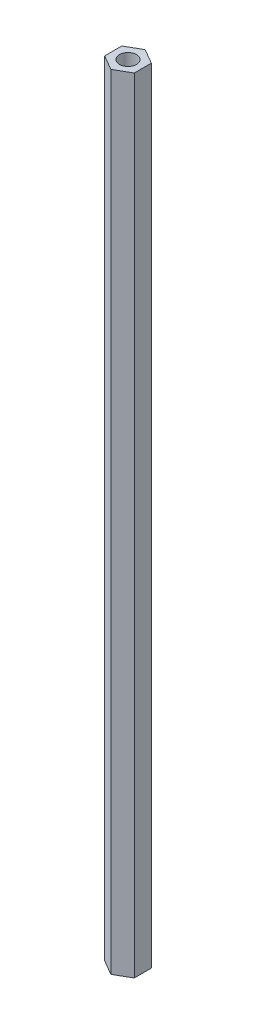
ISO-10303-21;
HEADER;
FILE_DESCRIPTION(('STEP AP214'),'2;1');
FILE_NAME('part.step','',(''),(''),'','','');
FILE_SCHEMA(('AUTOMOTIVE_DESIGN { 1 0 10303 214 1 1 1 1 }'));
ENDSEC;
DATA;
#1=APPLICATION_CONTEXT('core data for automotive mechanical design processes');
#2=APPLICATION_PROTOCOL_DEFINITION('international standard','automotive_design',2000,#1);
#3=PRODUCT_CONTEXT('',#1,'mechanical');
#4=PRODUCT('Part','Part','',(#3));
#5=PRODUCT_RELATED_PRODUCT_CATEGORY('part','',(#4));
#6=PRODUCT_DEFINITION_FORMATION('','',#4);
#7=PRODUCT_DEFINITION_CONTEXT('part definition',#1,'design');
#8=PRODUCT_DEFINITION('design','',#6,#7);
#9=PRODUCT_DEFINITION_SHAPE('','',#8);
#10=(LENGTH_UNIT() NAMED_UNIT(*) SI_UNIT(.MILLI.,.METRE.));
#11=(NAMED_UNIT(*) PLANE_ANGLE_UNIT() SI_UNIT($,.RADIAN.));
#12=(NAMED_UNIT(*) SI_UNIT($,.STERADIAN.) SOLID_ANGLE_UNIT());
#13=UNCERTAINTY_MEASURE_WITH_UNIT(LENGTH_MEASURE(1.E-05),#10,'distance_accuracy_value','');
#14=(GEOMETRIC_REPRESENTATION_CONTEXT(3) GLOBAL_UNCERTAINTY_ASSIGNED_CONTEXT((#13)) GLOBAL_UNIT_ASSIGNED_CONTEXT((#10,
#11,#12)) REPRESENTATION_CONTEXT('',''));
#15=CARTESIAN_POINT('',(0.,0.,0.));
#16=DIRECTION('',(0.,0.,1.));
#17=DIRECTION('',(1.,0.,0.));
#18=AXIS2_PLACEMENT_3D('',#15,#16,#17);
#19=CARTESIAN_POINT('',(0.,229.,-5.));
#20=DIRECTION('',(0.,1.,0.));
#21=DIRECTION('',(0.,0.,1.));
#22=AXIS2_PLACEMENT_3D('',#19,#20,#21);
#23=PLANE('',#22);
#24=DIRECTION('',(-0.866025403784439,0.,-0.5));
#25=VECTOR('',#24,1.);
#26=CARTESIAN_POINT('',(4.33012701892219,229.,-2.5));
#27=LINE('',#26,#25);
#28=CARTESIAN_POINT('',(4.33012701892219,229.,-2.5));
#29=VERTEX_POINT('',#28);
#30=CARTESIAN_POINT('',(0.,229.,-5.));
#31=VERTEX_POINT('',#30);
#32=EDGE_CURVE('E127',#29,#31,#27,.T.);
#33=ORIENTED_EDGE('',*,*,#32,.T.);
#34=DIRECTION('',(-0.866025403784439,0.,0.5));
#35=VECTOR('',#34,1.);
#36=CARTESIAN_POINT('',(0.,229.,-5.));
#37=LINE('',#36,#35);
#38=CARTESIAN_POINT('',(-4.33012701892219,229.,-2.5));
#39=VERTEX_POINT('',#38);
#40=EDGE_CURVE('E85',#31,#39,#37,.T.);
#41=ORIENTED_EDGE('',*,*,#40,.T.);
#42=DIRECTION('',(0.,0.,1.));
#43=VECTOR('',#42,1.);
#44=CARTESIAN_POINT('',(-4.33012701892219,229.,-2.5));
#45=LINE('',#44,#43);
#46=CARTESIAN_POINT('',(-4.33012701892219,229.,2.5));
#47=VERTEX_POINT('',#46);
#48=EDGE_CURVE('E98',#39,#47,#45,.T.);
#49=ORIENTED_EDGE('',*,*,#48,.T.);
#50=DIRECTION('',(0.866025403784439,0.,0.5));
#51=VECTOR('',#50,1.);
#52=CARTESIAN_POINT('',(-4.33012701892219,229.,2.5));
#53=LINE('',#52,#51);
#54=CARTESIAN_POINT('',(0.,229.,5.));
#55=VERTEX_POINT('',#54);
#56=EDGE_CURVE('E92',#47,#55,#53,.T.);
#57=ORIENTED_EDGE('',*,*,#56,.T.);
#58=DIRECTION('',(0.866025403784439,0.,-0.5));
#59=VECTOR('',#58,1.);
#60=CARTESIAN_POINT('',(0.,229.,5.));
#61=LINE('',#60,#59);
#62=CARTESIAN_POINT('',(4.33012701892219,229.,2.5));
#63=VERTEX_POINT('',#62);
#64=EDGE_CURVE('E96',#55,#63,#61,.T.);
#65=ORIENTED_EDGE('',*,*,#64,.T.);
#66=DIRECTION('',(0.,0.,-1.));
#67=VECTOR('',#66,1.);
#68=CARTESIAN_POINT('',(4.33012701892219,229.,2.5));
#69=LINE('',#68,#67);
#70=EDGE_CURVE('E48',#63,#29,#69,.T.);
#71=ORIENTED_EDGE('',*,*,#70,.T.);
#72=EDGE_LOOP('',(#33,#41,#49,#57,#65,#71));
#73=FACE_BOUND('',#72,.T.);
#74=CARTESIAN_POINT('',(0.,229.,0.));
#75=DIRECTION('',(0.,1.,0.));
#76=DIRECTION('',(0.,0.,1.));
#77=AXIS2_PLACEMENT_3D('',#74,#75,#76);
#78=CIRCLE('',#77,2.5);
#79=CARTESIAN_POINT('',(0.,229.,2.5));
#80=VERTEX_POINT('',#79);
#81=EDGE_CURVE('E120',#80,#80,#78,.T.);
#82=ORIENTED_EDGE('',*,*,#81,.F.);
#83=EDGE_LOOP('',(#82));
#84=FACE_BOUND('',#83,.T.);
#85=ADVANCED_FACE('F31',(#73,#84),#23,.T.);
#86=CARTESIAN_POINT('',(0.,0.,-5.));
#87=DIRECTION('',(0.,1.,0.));
#88=DIRECTION('',(0.,0.,1.));
#89=AXIS2_PLACEMENT_3D('',#86,#87,#88);
#90=PLANE('',#89);
#91=DIRECTION('',(-0.866025403784439,0.,-0.5));
#92=VECTOR('',#91,1.);
#93=CARTESIAN_POINT('',(4.33012701892219,0.,-2.5));
#94=LINE('',#93,#92);
#95=CARTESIAN_POINT('',(4.33012701892219,0.,-2.5));
#96=VERTEX_POINT('',#95);
#97=CARTESIAN_POINT('',(0.,0.,-5.));
#98=VERTEX_POINT('',#97);
#99=EDGE_CURVE('E116',#96,#98,#94,.T.);
#100=ORIENTED_EDGE('',*,*,#99,.F.);
#101=DIRECTION('',(0.,0.,-1.));
#102=VECTOR('',#101,1.);
#103=CARTESIAN_POINT('',(4.33012701892219,0.,2.5));
#104=LINE('',#103,#102);
#105=CARTESIAN_POINT('',(4.33012701892219,0.,2.5));
#106=VERTEX_POINT('',#105);
#107=EDGE_CURVE('E77',#106,#96,#104,.T.);
#108=ORIENTED_EDGE('',*,*,#107,.F.);
#109=DIRECTION('',(0.866025403784439,0.,-0.5));
#110=VECTOR('',#109,1.);
#111=CARTESIAN_POINT('',(0.,0.,5.));
#112=LINE('',#111,#110);
#113=CARTESIAN_POINT('',(0.,0.,5.));
#114=VERTEX_POINT('',#113);
#115=EDGE_CURVE('E71',#114,#106,#112,.T.);
#116=ORIENTED_EDGE('',*,*,#115,.F.);
#117=DIRECTION('',(0.866025403784439,0.,0.5));
#118=VECTOR('',#117,1.);
#119=CARTESIAN_POINT('',(-4.33012701892219,0.,2.5));
#120=LINE('',#119,#118);
#121=CARTESIAN_POINT('',(-4.33012701892219,0.,2.5));
#122=VERTEX_POINT('',#121);
#123=EDGE_CURVE('E106',#122,#114,#120,.T.);
#124=ORIENTED_EDGE('',*,*,#123,.F.);
#125=DIRECTION('',(0.,0.,1.));
#126=VECTOR('',#125,1.);
#127=CARTESIAN_POINT('',(-4.33012701892219,0.,-2.5));
#128=LINE('',#127,#126);
#129=CARTESIAN_POINT('',(-4.33012701892219,0.,-2.5));
#130=VERTEX_POINT('',#129);
#131=EDGE_CURVE('E122',#130,#122,#128,.T.);
#132=ORIENTED_EDGE('',*,*,#131,.F.);
#133=DIRECTION('',(-0.866025403784439,0.,0.5));
#134=VECTOR('',#133,1.);
#135=CARTESIAN_POINT('',(0.,0.,-5.));
#136=LINE('',#135,#134);
#137=EDGE_CURVE('E119',#98,#130,#136,.T.);
#138=ORIENTED_EDGE('',*,*,#137,.F.);
#139=EDGE_LOOP('',(#100,#108,#116,#124,#132,#138));
#140=FACE_BOUND('',#139,.T.);
#141=CARTESIAN_POINT('',(0.,0.,0.));
#142=DIRECTION('',(0.,1.,0.));
#143=DIRECTION('',(0.,0.,1.));
#144=AXIS2_PLACEMENT_3D('',#141,#142,#143);
#145=CIRCLE('',#144,2.5);
#146=CARTESIAN_POINT('',(0.,0.,2.5));
#147=VERTEX_POINT('',#146);
#148=EDGE_CURVE('E220',#147,#147,#145,.T.);
#149=ORIENTED_EDGE('',*,*,#148,.T.);
#150=EDGE_LOOP('',(#149));
#151=FACE_BOUND('',#150,.T.);
#152=ADVANCED_FACE('F136',(#140,#151),#90,.F.);
#153=CARTESIAN_POINT('',(4.33012701892219,229.,-2.5));
#154=DIRECTION('',(-0.5,0.,0.866025403784439));
#155=DIRECTION('',(0.866025403784439,0.,0.5));
#156=AXIS2_PLACEMENT_3D('',#153,#154,#155);
#157=PLANE('',#156);
#158=ORIENTED_EDGE('',*,*,#99,.T.);
#159=DIRECTION('',(0.,-1.,0.));
#160=VECTOR('',#159,1.);
#161=CARTESIAN_POINT('',(0.,229.,-5.));
#162=LINE('',#161,#160);
#163=EDGE_CURVE('E11',#31,#98,#162,.T.);
#164=ORIENTED_EDGE('',*,*,#163,.F.);
#165=ORIENTED_EDGE('',*,*,#32,.F.);
#166=DIRECTION('',(0.,-1.,0.));
#167=VECTOR('',#166,1.);
#168=CARTESIAN_POINT('',(4.33012701892219,229.,-2.5));
#169=LINE('',#168,#167);
#170=EDGE_CURVE('E112',#29,#96,#169,.T.);
#171=ORIENTED_EDGE('',*,*,#170,.T.);
#172=EDGE_LOOP('',(#158,#164,#165,#171));
#173=FACE_BOUND('',#172,.T.);
#174=ADVANCED_FACE('F33',(#173),#157,.F.);
#175=CARTESIAN_POINT('',(0.,229.,-5.));
#176=DIRECTION('',(0.5,0.,0.866025403784439));
#177=DIRECTION('',(0.866025403784439,0.,-0.5));
#178=AXIS2_PLACEMENT_3D('',#175,#176,#177);
#179=PLANE('',#178);
#180=ORIENTED_EDGE('',*,*,#137,.T.);
#181=DIRECTION('',(0.,-1.,0.));
#182=VECTOR('',#181,1.);
#183=CARTESIAN_POINT('',(-4.33012701892219,229.,-2.5));
#184=LINE('',#183,#182);
#185=EDGE_CURVE('E40',#39,#130,#184,.T.);
#186=ORIENTED_EDGE('',*,*,#185,.F.);
#187=ORIENTED_EDGE('',*,*,#40,.F.);
#188=ORIENTED_EDGE('',*,*,#163,.T.);
#189=EDGE_LOOP('',(#180,#186,#187,#188));
#190=FACE_BOUND('',#189,.T.);
#191=ADVANCED_FACE('F161',(#190),#179,.F.);
#192=CARTESIAN_POINT('',(-4.33012701892219,229.,-2.5));
#193=DIRECTION('',(1.,0.,0.));
#194=DIRECTION('',(0.,0.,-1.));
#195=AXIS2_PLACEMENT_3D('',#192,#193,#194);
#196=PLANE('',#195);
#197=ORIENTED_EDGE('',*,*,#131,.T.);
#198=DIRECTION('',(0.,-1.,0.));
#199=VECTOR('',#198,1.);
#200=CARTESIAN_POINT('',(-4.33012701892219,229.,2.5));
#201=LINE('',#200,#199);
#202=EDGE_CURVE('E107',#47,#122,#201,.T.);
#203=ORIENTED_EDGE('',*,*,#202,.F.);
#204=ORIENTED_EDGE('',*,*,#48,.F.);
#205=ORIENTED_EDGE('',*,*,#185,.T.);
#206=EDGE_LOOP('',(#197,#203,#204,#205));
#207=FACE_BOUND('',#206,.T.);
#208=ADVANCED_FACE('F133',(#207),#196,.F.);
#209=CARTESIAN_POINT('',(-4.33012701892219,229.,2.5));
#210=DIRECTION('',(0.5,0.,-0.866025403784439));
#211=DIRECTION('',(-0.866025403784439,0.,-0.5));
#212=AXIS2_PLACEMENT_3D('',#209,#210,#211);
#213=PLANE('',#212);
#214=ORIENTED_EDGE('',*,*,#123,.T.);
#215=DIRECTION('',(0.,-1.,0.));
#216=VECTOR('',#215,1.);
#217=CARTESIAN_POINT('',(0.,229.,5.));
#218=LINE('',#217,#216);
#219=EDGE_CURVE('E103',#55,#114,#218,.T.);
#220=ORIENTED_EDGE('',*,*,#219,.F.);
#221=ORIENTED_EDGE('',*,*,#56,.F.);
#222=ORIENTED_EDGE('',*,*,#202,.T.);
#223=EDGE_LOOP('',(#214,#220,#221,#222));
#224=FACE_BOUND('',#223,.T.);
#225=ADVANCED_FACE('F104',(#224),#213,.F.);
#226=CARTESIAN_POINT('',(0.,229.,5.));
#227=DIRECTION('',(-0.5,0.,-0.866025403784439));
#228=DIRECTION('',(-0.866025403784439,0.,0.5));
#229=AXIS2_PLACEMENT_3D('',#226,#227,#228);
#230=PLANE('',#229);
#231=ORIENTED_EDGE('',*,*,#115,.T.);
#232=DIRECTION('',(0.,-1.,0.));
#233=VECTOR('',#232,1.);
#234=CARTESIAN_POINT('',(4.33012701892219,229.,2.5));
#235=LINE('',#234,#233);
#236=EDGE_CURVE('E108',#63,#106,#235,.T.);
#237=ORIENTED_EDGE('',*,*,#236,.F.);
#238=ORIENTED_EDGE('',*,*,#64,.F.);
#239=ORIENTED_EDGE('',*,*,#219,.T.);
#240=EDGE_LOOP('',(#231,#237,#238,#239));
#241=FACE_BOUND('',#240,.T.);
#242=ADVANCED_FACE('F110',(#241),#230,.F.);
#243=CARTESIAN_POINT('',(4.33012701892219,229.,2.5));
#244=DIRECTION('',(-1.,0.,0.));
#245=DIRECTION('',(0.,0.,1.));
#246=AXIS2_PLACEMENT_3D('',#243,#244,#245);
#247=PLANE('',#246);
#248=ORIENTED_EDGE('',*,*,#107,.T.);
#249=ORIENTED_EDGE('',*,*,#170,.F.);
#250=ORIENTED_EDGE('',*,*,#70,.F.);
#251=ORIENTED_EDGE('',*,*,#236,.T.);
#252=EDGE_LOOP('',(#248,#249,#250,#251));
#253=FACE_BOUND('',#252,.T.);
#254=ADVANCED_FACE('F141',(#253),#247,.F.);
#255=CARTESIAN_POINT('',(0.,229.,0.));
#256=DIRECTION('',(0.,-1.,0.));
#257=DIRECTION('',(0.,0.,-1.));
#258=AXIS2_PLACEMENT_3D('',#255,#256,#257);
#259=CYLINDRICAL_SURFACE('',#258,2.5);
#260=ORIENTED_EDGE('',*,*,#81,.T.);
#261=EDGE_LOOP('',(#260));
#262=FACE_BOUND('',#261,.T.);
#263=ORIENTED_EDGE('',*,*,#148,.F.);
#264=EDGE_LOOP('',(#263));
#265=FACE_BOUND('',#264,.T.);
#266=ADVANCED_FACE('F143',(#262,#265),#259,.F.);
#267=CLOSED_SHELL('',(#85,#152,#174,#191,#208,#225,#242,#254,#266));
#268=MANIFOLD_SOLID_BREP('B2',#267);
#269=ADVANCED_BREP_SHAPE_REPRESENTATION('',(#18,#268),#14);
#270=SHAPE_DEFINITION_REPRESENTATION(#9,#269);
ENDSEC;
END-ISO-10303-21;
